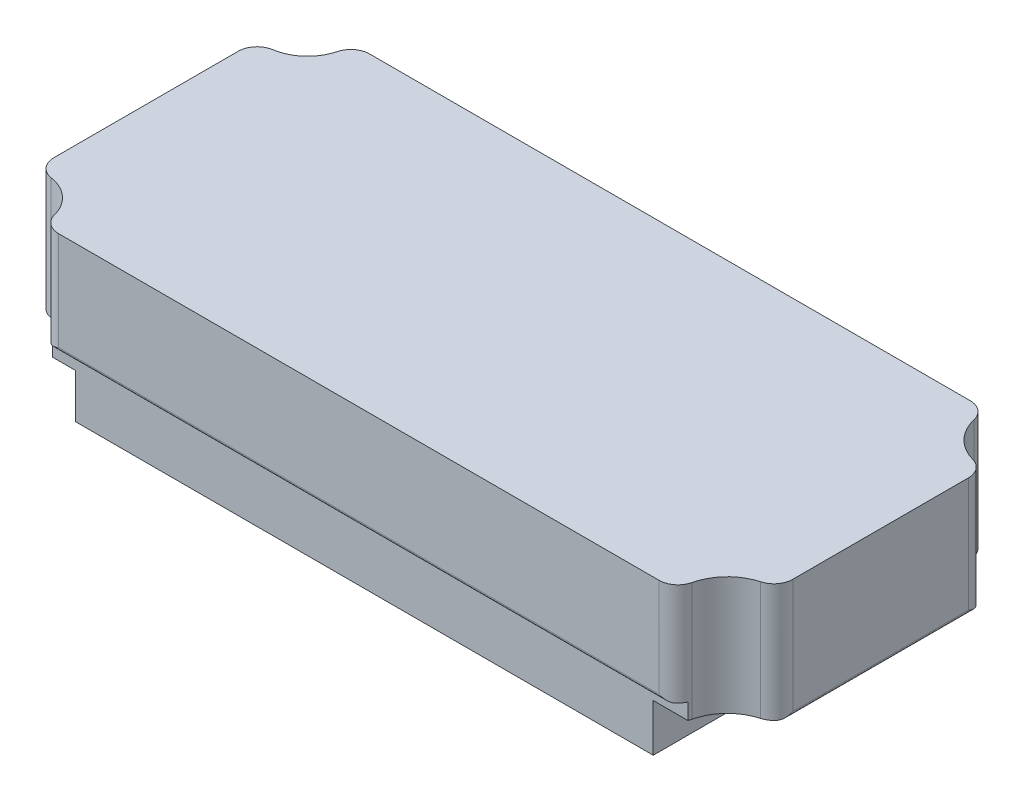
ISO-10303-21;
HEADER;
FILE_DESCRIPTION(('STEP AP214'),'2;1');
FILE_NAME('part.step','',(''),(''),'','','');
FILE_SCHEMA(('AUTOMOTIVE_DESIGN { 1 0 10303 214 1 1 1 1 }'));
ENDSEC;
DATA;
#1=APPLICATION_CONTEXT('core data for automotive mechanical design processes');
#2=APPLICATION_PROTOCOL_DEFINITION('international standard','automotive_design',2000,#1);
#3=PRODUCT_CONTEXT('',#1,'mechanical');
#4=PRODUCT('Part','Part','',(#3));
#5=PRODUCT_RELATED_PRODUCT_CATEGORY('part','',(#4));
#6=PRODUCT_DEFINITION_FORMATION('','',#4);
#7=PRODUCT_DEFINITION_CONTEXT('part definition',#1,'design');
#8=PRODUCT_DEFINITION('design','',#6,#7);
#9=PRODUCT_DEFINITION_SHAPE('','',#8);
#10=(LENGTH_UNIT() NAMED_UNIT(*) SI_UNIT(.MILLI.,.METRE.));
#11=(NAMED_UNIT(*) PLANE_ANGLE_UNIT() SI_UNIT($,.RADIAN.));
#12=(NAMED_UNIT(*) SI_UNIT($,.STERADIAN.) SOLID_ANGLE_UNIT());
#13=UNCERTAINTY_MEASURE_WITH_UNIT(LENGTH_MEASURE(1.E-05),#10,'distance_accuracy_value','');
#14=(GEOMETRIC_REPRESENTATION_CONTEXT(3) GLOBAL_UNCERTAINTY_ASSIGNED_CONTEXT((#13)) GLOBAL_UNIT_ASSIGNED_CONTEXT((#10,
#11,#12)) REPRESENTATION_CONTEXT('',''));
#15=CARTESIAN_POINT('',(0.,0.,0.));
#16=DIRECTION('',(0.,0.,1.));
#17=DIRECTION('',(1.,0.,0.));
#18=AXIS2_PLACEMENT_3D('',#15,#16,#17);
#19=CARTESIAN_POINT('',(-39.4234207868496,21.85,18.0099999999963));
#20=DIRECTION('',(0.,-1.,0.));
#21=DIRECTION('',(0.,0.,-1.));
#22=AXIS2_PLACEMENT_3D('',#19,#20,#21);
#23=CYLINDRICAL_SURFACE('',#22,2.49000000000371);
#24=CARTESIAN_POINT('',(-39.4234207868496,5.85,18.0099999999963));
#25=DIRECTION('',(0.,-1.,0.));
#26=DIRECTION('',(0.,0.,-1.));
#27=AXIS2_PLACEMENT_3D('',#24,#25,#26);
#28=CIRCLE('',#27,2.49000000000371);
#29=CARTESIAN_POINT('',(-41.7081527186112,5.85,19.));
#30=VERTEX_POINT('',#29);
#31=CARTESIAN_POINT('',(-41.833947517424,5.85,18.634068010076));
#32=VERTEX_POINT('',#31);
#33=EDGE_CURVE('E318',#30,#32,#28,.T.);
#34=ORIENTED_EDGE('',*,*,#33,.F.);
#35=DIRECTION('',(0.,-1.,0.));
#36=VECTOR('',#35,1.);
#37=CARTESIAN_POINT('',(-41.7081527186112,21.85,19.));
#38=LINE('',#37,#36);
#39=CARTESIAN_POINT('',(-41.7081527186112,8.35,19.));
#40=VERTEX_POINT('',#39);
#41=EDGE_CURVE('E630',#40,#30,#38,.T.);
#42=ORIENTED_EDGE('',*,*,#41,.F.);
#43=CARTESIAN_POINT('',(-39.4234207868496,8.35,18.0099999999963));
#44=DIRECTION('',(0.,-1.,0.));
#45=DIRECTION('',(0.,0.,-1.));
#46=AXIS2_PLACEMENT_3D('',#43,#44,#45);
#47=CIRCLE('',#46,2.49000000000371);
#48=CARTESIAN_POINT('',(-40.9200837415604,8.35,20.));
#49=VERTEX_POINT('',#48);
#50=EDGE_CURVE('E430',#49,#40,#47,.T.);
#51=ORIENTED_EDGE('',*,*,#50,.F.);
#52=CARTESIAN_POINT('',(-40.9200837415604,8.35,20.));
#53=CARTESIAN_POINT('',(-40.8886968921512,8.35001842418056,20.0236123195986));
#54=CARTESIAN_POINT('',(-40.8567785136693,8.3516705893633,20.0464488723854));
#55=CARTESIAN_POINT('',(-40.7921398322998,8.35774286900045,20.0904390050354));
#56=CARTESIAN_POINT('',(-40.7594211696703,8.36215771425095,20.1115957024869));
#57=CARTESIAN_POINT('',(-40.6935463648069,8.37322199606692,20.1520474858787));
#58=CARTESIAN_POINT('',(-40.6603946958646,8.37985607094456,20.1713542266435));
#59=CARTESIAN_POINT('',(-40.5935524581982,8.39499936083978,20.2082607478386));
#60=CARTESIAN_POINT('',(-40.5598615489058,8.40350980805456,20.2258593955906));
#61=CARTESIAN_POINT('',(-40.4705197955371,8.42798978748029,20.2699790746975));
#62=CARTESIAN_POINT('',(-40.4145127997427,8.44526366837736,20.2950674194311));
#63=CARTESIAN_POINT('',(-40.3017262532036,8.48289528376704,20.3407481172562));
#64=CARTESIAN_POINT('',(-40.2449463855545,8.50325432021062,20.3613385632128));
#65=CARTESIAN_POINT('',(-40.0733593150087,8.56786691046003,20.4166898107985));
#66=CARTESIAN_POINT('',(-39.9576488122184,8.61555155971634,20.4448633881303));
#67=CARTESIAN_POINT('',(-39.7735259173764,8.6944758334201,20.4762307918894));
#68=CARTESIAN_POINT('',(-39.7053544997696,8.7243554537804,20.4849370573848));
#69=CARTESIAN_POINT('',(-39.5689552918689,8.78479751133603,20.4966827348011));
#70=CARTESIAN_POINT('',(-39.5007279148792,8.81535839636182,20.4997339145209));
#71=CARTESIAN_POINT('',(-39.4294923256068,8.84727928134149,20.4999944475638));
#72=CARTESIAN_POINT('',(-39.4264565232585,8.84863965743936,20.4999999990283));
#73=CARTESIAN_POINT('',(-39.4234207868496,8.85000000000043,20.5));
#74=B_SPLINE_CURVE_WITH_KNOTS('',3,(#52,#53,#54,#55,#56,#57,#58,#59,#60,#61,#62,#63,#64,#65,#66,
#67,#68,#69,#70,#71,#72,#73),.UNSPECIFIED.,.F.,.F.,(4,2,2,2,2,2,2,2,2,2,4),(0.,
0.117726633475876,0.235229410834652,0.35193509864507,0.468717655541683,0.659676139059862,
0.850715433585463,1.2339705990191,1.45863657718136,1.68283451552407,1.69281450939726),.UNSPECIFIED.);
#75=CARTESIAN_POINT('',(-39.4234207868496,8.85,20.5));
#76=VERTEX_POINT('',#75);
#77=EDGE_CURVE('E421',#76,#49,#74,.F.);
#78=ORIENTED_EDGE('',*,*,#77,.F.);
#79=DIRECTION('',(0.,-1.,0.));
#80=VECTOR('',#79,1.);
#81=CARTESIAN_POINT('',(-39.4234207868496,21.85,20.5));
#82=LINE('',#81,#80);
#83=CARTESIAN_POINT('',(-39.4234207868496,21.85,20.5));
#84=VERTEX_POINT('',#83);
#85=EDGE_CURVE('E511',#84,#76,#82,.T.);
#86=ORIENTED_EDGE('',*,*,#85,.F.);
#87=CARTESIAN_POINT('',(-39.4234207868496,21.85,18.0099999999963));
#88=DIRECTION('',(0.,1.,0.));
#89=DIRECTION('',(0.,0.,1.));
#90=AXIS2_PLACEMENT_3D('',#87,#88,#89);
#91=CIRCLE('',#90,2.49000000000371);
#92=CARTESIAN_POINT('',(-41.833947517424,21.85,18.634068010076));
#93=VERTEX_POINT('',#92);
#94=EDGE_CURVE('E533',#93,#84,#91,.T.);
#95=ORIENTED_EDGE('',*,*,#94,.F.);
#96=DIRECTION('',(0.,-1.,0.));
#97=VECTOR('',#96,1.);
#98=CARTESIAN_POINT('',(-41.833947517424,21.85,18.634068010076));
#99=LINE('',#98,#97);
#100=EDGE_CURVE('E474',#93,#32,#99,.T.);
#101=ORIENTED_EDGE('',*,*,#100,.T.);
#102=EDGE_LOOP('',(#34,#42,#51,#78,#86,#95,#101));
#103=FACE_BOUND('',#102,.T.);
#104=ADVANCED_FACE('F38',(#103),#23,.T.);
#105=CARTESIAN_POINT('',(39.7095652284968,21.85,18.0099999999986));
#106=DIRECTION('',(0.,-1.,0.));
#107=DIRECTION('',(0.,0.,-1.));
#108=AXIS2_PLACEMENT_3D('',#105,#106,#107);
#109=CYLINDRICAL_SURFACE('',#108,2.49000000000138);
#110=CARTESIAN_POINT('',(39.7095652284968,6.25,18.0099999999986));
#111=DIRECTION('',(0.,-1.,0.));
#112=DIRECTION('',(0.,0.,-1.));
#113=AXIS2_PLACEMENT_3D('',#110,#111,#112);
#114=CIRCLE('',#113,2.49000000000138);
#115=CARTESIAN_POINT('',(42.134162777816,6.25,18.576945080092));
#116=VERTEX_POINT('',#115);
#117=CARTESIAN_POINT('',(41.9942971602569,6.25,19.));
#118=VERTEX_POINT('',#117);
#119=EDGE_CURVE('E336',#116,#118,#114,.T.);
#120=ORIENTED_EDGE('',*,*,#119,.F.);
#121=DIRECTION('',(0.,-1.,0.));
#122=VECTOR('',#121,1.);
#123=CARTESIAN_POINT('',(42.134162777816,21.85,18.576945080092));
#124=LINE('',#123,#122);
#125=CARTESIAN_POINT('',(42.134162777816,21.85,18.576945080092));
#126=VERTEX_POINT('',#125);
#127=EDGE_CURVE('E512',#126,#116,#124,.T.);
#128=ORIENTED_EDGE('',*,*,#127,.F.);
#129=CARTESIAN_POINT('',(39.7095652284968,21.85,18.0099999999986));
#130=DIRECTION('',(0.,1.,0.));
#131=DIRECTION('',(0.,0.,1.));
#132=AXIS2_PLACEMENT_3D('',#129,#130,#131);
#133=CIRCLE('',#132,2.49000000000138);
#134=CARTESIAN_POINT('',(39.709565228497,21.85,20.5));
#135=VERTEX_POINT('',#134);
#136=EDGE_CURVE('E507',#135,#126,#133,.T.);
#137=ORIENTED_EDGE('',*,*,#136,.F.);
#138=DIRECTION('',(0.,-1.,0.));
#139=VECTOR('',#138,1.);
#140=CARTESIAN_POINT('',(39.709565228497,21.85,20.5));
#141=LINE('',#140,#139);
#142=CARTESIAN_POINT('',(39.7095652284968,8.85,20.5));
#143=VERTEX_POINT('',#142);
#144=EDGE_CURVE('E505',#135,#143,#141,.T.);
#145=ORIENTED_EDGE('',*,*,#144,.T.);
#146=CARTESIAN_POINT('',(41.2062281832068,8.35,20.));
#147=CARTESIAN_POINT('',(41.1748413337976,8.35001842418055,20.0236123195986));
#148=CARTESIAN_POINT('',(41.1429229553158,8.3516705893633,20.0464488723854));
#149=CARTESIAN_POINT('',(41.0782842739463,8.35774286900045,20.0904390050354));
#150=CARTESIAN_POINT('',(41.0455656113169,8.36215771425094,20.1115957024869));
#151=CARTESIAN_POINT('',(40.9796908064535,8.3732219960669,20.1520474858787));
#152=CARTESIAN_POINT('',(40.9465391375113,8.37985607094454,20.1713542266435));
#153=CARTESIAN_POINT('',(40.8796968998449,8.39499936083975,20.2082607478385));
#154=CARTESIAN_POINT('',(40.8460059905525,8.40350980805453,20.2258593955906));
#155=CARTESIAN_POINT('',(40.756664237184,8.42798978748023,20.2699790746974));
#156=CARTESIAN_POINT('',(40.7006572413896,8.44526366837728,20.295067419431));
#157=CARTESIAN_POINT('',(40.5878706948506,8.48289528376694,20.3407481172561));
#158=CARTESIAN_POINT('',(40.5310908272016,8.5032543202105,20.3613385632127));
#159=CARTESIAN_POINT('',(40.359503756656,8.56786691045986,20.4166898107984));
#160=CARTESIAN_POINT('',(40.2437932538658,8.61555155971612,20.4448633881302));
#161=CARTESIAN_POINT('',(40.0596703590239,8.69447583341988,20.4762307918893));
#162=CARTESIAN_POINT('',(39.9914989414171,8.72435545378022,20.4849370573848));
#163=CARTESIAN_POINT('',(39.8550997335162,8.78479751133593,20.4966827348011));
#164=CARTESIAN_POINT('',(39.7868723565265,8.81535839636177,20.4997339145209));
#165=CARTESIAN_POINT('',(39.7156367672539,8.84727928134148,20.4999944475638));
#166=CARTESIAN_POINT('',(39.7126009649057,8.84863965743936,20.4999999990283));
#167=CARTESIAN_POINT('',(39.7095652284968,8.85000000000043,20.5));
#168=B_SPLINE_CURVE_WITH_KNOTS('',3,(#146,#147,#148,#149,#150,#151,#152,#153,#154,#155,#156,
#157,#158,#159,#160,#161,#162,#163,#164,#165,#166,#167),.UNSPECIFIED.,.F.,.F.,(4,2,2,2,2,2,2,2,
2,2,4),(0.,0.117726633475785,0.23522941083446,0.351935098644792,0.468717655541302,
0.659676139059281,0.850715433584689,1.23397059901794,1.45863657718043,1.68283451552337,
1.69281450939657),.UNSPECIFIED.);
#169=CARTESIAN_POINT('',(41.2062281832068,8.35,20.));
#170=VERTEX_POINT('',#169);
#171=EDGE_CURVE('E396',#170,#143,#168,.T.);
#172=ORIENTED_EDGE('',*,*,#171,.F.);
#173=CARTESIAN_POINT('',(39.7095652284968,8.35,18.0099999999986));
#174=DIRECTION('',(0.,-1.,0.));
#175=DIRECTION('',(0.,0.,-1.));
#176=AXIS2_PLACEMENT_3D('',#173,#174,#175);
#177=CIRCLE('',#176,2.49000000000138);
#178=CARTESIAN_POINT('',(41.9942971602569,8.35,19.));
#179=VERTEX_POINT('',#178);
#180=EDGE_CURVE('E406',#179,#170,#177,.T.);
#181=ORIENTED_EDGE('',*,*,#180,.F.);
#182=DIRECTION('',(0.,-1.,0.));
#183=VECTOR('',#182,1.);
#184=CARTESIAN_POINT('',(41.9942971602569,21.85,19.));
#185=LINE('',#184,#183);
#186=EDGE_CURVE('E629',#118,#179,#185,.F.);
#187=ORIENTED_EDGE('',*,*,#186,.F.);
#188=EDGE_LOOP('',(#120,#128,#137,#145,#172,#181,#187));
#189=FACE_BOUND('',#188,.T.);
#190=ADVANCED_FACE('F387',(#189),#109,.T.);
#191=CARTESIAN_POINT('',(-45.9100000000024,0.,-12.1512039139768));
#192=DIRECTION('',(0.,1.,0.));
#193=DIRECTION('',(0.,0.,1.));
#194=AXIS2_PLACEMENT_3D('',#191,#192,#193);
#195=PLANE('',#194);
#196=DIRECTION('',(0.,0.,-1.));
#197=VECTOR('',#196,1.);
#198=CARTESIAN_POINT('',(37.44,0.,20.5));
#199=LINE('',#198,#197);
#200=CARTESIAN_POINT('',(37.44,0.,19.));
#201=VERTEX_POINT('',#200);
#202=CARTESIAN_POINT('',(37.44,0.,-20.5));
#203=VERTEX_POINT('',#202);
#204=EDGE_CURVE('E269',#201,#203,#199,.T.);
#205=ORIENTED_EDGE('',*,*,#204,.F.);
#206=DIRECTION('',(1.,0.,0.));
#207=VECTOR('',#206,1.);
#208=CARTESIAN_POINT('',(-45.9100000000024,0.,19.));
#209=LINE('',#208,#207);
#210=CARTESIAN_POINT('',(-38.7,0.,19.));
#211=VERTEX_POINT('',#210);
#212=EDGE_CURVE('E470',#211,#201,#209,.T.);
#213=ORIENTED_EDGE('',*,*,#212,.F.);
#214=DIRECTION('',(0.,0.,-1.));
#215=VECTOR('',#214,1.);
#216=CARTESIAN_POINT('',(-38.7,0.,20.5));
#217=LINE('',#216,#215);
#218=CARTESIAN_POINT('',(-38.7,0.,-20.5));
#219=VERTEX_POINT('',#218);
#220=EDGE_CURVE('E307',#211,#219,#217,.T.);
#221=ORIENTED_EDGE('',*,*,#220,.T.);
#222=DIRECTION('',(-1.,0.,0.));
#223=VECTOR('',#222,1.);
#224=CARTESIAN_POINT('',(39.709565228497,0.,-20.5));
#225=LINE('',#224,#223);
#226=EDGE_CURVE('E429',#203,#219,#225,.T.);
#227=ORIENTED_EDGE('',*,*,#226,.F.);
#228=EDGE_LOOP('',(#205,#213,#221,#227));
#229=FACE_BOUND('',#228,.T.);
#230=ADVANCED_FACE('F391',(#229),#195,.F.);
#231=CARTESIAN_POINT('',(-45.9100000000024,21.85,-12.1512039139768));
#232=DIRECTION('',(0.,-1.,0.));
#233=DIRECTION('',(0.,0.,-1.));
#234=AXIS2_PLACEMENT_3D('',#231,#232,#233);
#235=CYLINDRICAL_SURFACE('',#234,2.48999999999756);
#236=CARTESIAN_POINT('',(-45.9100000000024,5.85,-12.1512039139768));
#237=DIRECTION('',(0.,-1.,0.));
#238=DIRECTION('',(0.,0.,-1.));
#239=AXIS2_PLACEMENT_3D('',#236,#237,#238);
#240=CIRCLE('',#239,2.48999999999756);
#241=CARTESIAN_POINT('',(-47.9,5.85,-13.6478668686856));
#242=VERTEX_POINT('',#241);
#243=CARTESIAN_POINT('',(-46.286322286387,5.85,-14.612602202909));
#244=VERTEX_POINT('',#243);
#245=EDGE_CURVE('E333',#242,#244,#240,.T.);
#246=ORIENTED_EDGE('',*,*,#245,.F.);
#247=CARTESIAN_POINT('',(-47.9,5.85,-13.6478668686856));
#248=CARTESIAN_POINT('',(-47.9236123195986,5.85001842418056,-13.6164800192764));
#249=CARTESIAN_POINT('',(-47.9464488723854,5.8516705893633,-13.5845616407947));
#250=CARTESIAN_POINT('',(-47.9904390050353,5.85774286900044,-13.5199229594253));
#251=CARTESIAN_POINT('',(-48.0115957024868,5.86215771425093,-13.4872042967959));
#252=CARTESIAN_POINT('',(-48.0520474858786,5.87322199606688,-13.4213294919326));
#253=CARTESIAN_POINT('',(-48.0713542266434,5.87985607094451,-13.3881778229905));
#254=CARTESIAN_POINT('',(-48.1082607478384,5.89499936083969,-13.3213355853242));
#255=CARTESIAN_POINT('',(-48.1258593955904,5.90350980805446,-13.2876446760319));
#256=CARTESIAN_POINT('',(-48.1699790746973,5.92798978748013,-13.1983029226635));
#257=CARTESIAN_POINT('',(-48.1950674194308,5.94526366837715,-13.1422959268692));
#258=CARTESIAN_POINT('',(-48.2407481172559,5.98289528376675,-13.0295093803305));
#259=CARTESIAN_POINT('',(-48.2613385632125,6.00325432021029,-12.9727295126816));
#260=CARTESIAN_POINT('',(-48.3166898107982,6.06786691045954,-12.8011424421363));
#261=CARTESIAN_POINT('',(-48.34486338813,6.11555155971568,-12.6854319393463));
#262=CARTESIAN_POINT('',(-48.3762307918892,6.19447583341955,-12.5013090445046));
#263=CARTESIAN_POINT('',(-48.3849370573847,6.22435545378003,-12.4331376268976));
#264=CARTESIAN_POINT('',(-48.3966827348011,6.28479751133567,-12.2967384189964));
#265=CARTESIAN_POINT('',(-48.3997339145209,6.31535839636128,-12.2285110420065));
#266=CARTESIAN_POINT('',(-48.3999944475638,6.34727928134144,-12.157275452734));
#267=CARTESIAN_POINT('',(-48.3999999990283,6.34863965743934,-12.1542396503857));
#268=CARTESIAN_POINT('',(-48.4,6.35000000000042,-12.1512039139768));
#269=B_SPLINE_CURVE_WITH_KNOTS('',3,(#247,#248,#249,#250,#251,#252,#253,#254,#255,#256,#257,
#258,#259,#260,#261,#262,#263,#264,#265,#266,#267,#268),.UNSPECIFIED.,.F.,.F.,(4,2,2,2,2,2,2,2,
2,2,4),(0.,0.117726633475636,0.23522941083417,0.35193509864432,0.468717655540657,
0.659676139058309,0.850715433583384,1.233970599016,1.45863657717891,1.68283451552225,
1.69281450939544),.UNSPECIFIED.);
#270=CARTESIAN_POINT('',(-48.4,6.35000000000042,-12.151203913975));
#271=VERTEX_POINT('',#270);
#272=EDGE_CURVE('E363',#271,#242,#269,.F.);
#273=ORIENTED_EDGE('',*,*,#272,.F.);
#274=DIRECTION('',(0.,-1.,0.));
#275=VECTOR('',#274,1.);
#276=CARTESIAN_POINT('',(-48.4,21.85,-12.151203913975));
#277=LINE('',#276,#275);
#278=CARTESIAN_POINT('',(-48.4,21.85,-12.151203913975));
#279=VERTEX_POINT('',#278);
#280=EDGE_CURVE('E458',#279,#271,#277,.T.);
#281=ORIENTED_EDGE('',*,*,#280,.F.);
#282=CARTESIAN_POINT('',(-45.9100000000024,21.85,-12.1512039139768));
#283=DIRECTION('',(0.,1.,0.));
#284=DIRECTION('',(0.,0.,1.));
#285=AXIS2_PLACEMENT_3D('',#282,#283,#284);
#286=CIRCLE('',#285,2.48999999999756);
#287=CARTESIAN_POINT('',(-46.286322286387,21.85,-14.612602202909));
#288=VERTEX_POINT('',#287);
#289=EDGE_CURVE('E432',#288,#279,#286,.T.);
#290=ORIENTED_EDGE('',*,*,#289,.F.);
#291=DIRECTION('',(0.,-1.,0.));
#292=VECTOR('',#291,1.);
#293=CARTESIAN_POINT('',(-46.286322286387,21.85,-14.612602202909));
#294=LINE('',#293,#292);
#295=EDGE_CURVE('E587',#288,#244,#294,.T.);
#296=ORIENTED_EDGE('',*,*,#295,.T.);
#297=EDGE_LOOP('',(#246,#273,#281,#290,#296));
#298=FACE_BOUND('',#297,.T.);
#299=ADVANCED_FACE('F40',(#298),#235,.T.);
#300=CARTESIAN_POINT('',(-48.4,21.85,-12.151203913975));
#301=DIRECTION('',(1.,0.,0.));
#302=DIRECTION('',(0.,0.,-1.));
#303=AXIS2_PLACEMENT_3D('',#300,#301,#302);
#304=PLANE('',#303);
#305=DIRECTION('',(0.,0.,-1.));
#306=VECTOR('',#305,1.);
#307=CARTESIAN_POINT('',(-48.4,6.35000000000042,20.5));
#308=LINE('',#307,#306);
#309=CARTESIAN_POINT('',(-48.4,6.35000000000042,12.1512039139768));
#310=VERTEX_POINT('',#309);
#311=EDGE_CURVE('E298',#310,#271,#308,.T.);
#312=ORIENTED_EDGE('',*,*,#311,.F.);
#313=DIRECTION('',(0.,-1.,0.));
#314=VECTOR('',#313,1.);
#315=CARTESIAN_POINT('',(-48.4,21.85,12.151203913975));
#316=LINE('',#315,#314);
#317=CARTESIAN_POINT('',(-48.4,21.85,12.151203913975));
#318=VERTEX_POINT('',#317);
#319=EDGE_CURVE('E455',#318,#310,#316,.T.);
#320=ORIENTED_EDGE('',*,*,#319,.F.);
#321=DIRECTION('',(0.,0.,1.));
#322=VECTOR('',#321,1.);
#323=CARTESIAN_POINT('',(-48.4,21.85,-12.151203913975));
#324=LINE('',#323,#322);
#325=EDGE_CURVE('E582',#279,#318,#324,.T.);
#326=ORIENTED_EDGE('',*,*,#325,.F.);
#327=ORIENTED_EDGE('',*,*,#280,.T.);
#328=EDGE_LOOP('',(#312,#320,#326,#327));
#329=FACE_BOUND('',#328,.T.);
#330=ADVANCED_FACE('F443',(#329),#304,.F.);
#331=CARTESIAN_POINT('',(-45.9100000000023,21.85,12.1512039139768));
#332=DIRECTION('',(0.,-1.,0.));
#333=DIRECTION('',(0.,0.,-1.));
#334=AXIS2_PLACEMENT_3D('',#331,#332,#333);
#335=CYLINDRICAL_SURFACE('',#334,2.48999999999768);
#336=CARTESIAN_POINT('',(-45.9100000000023,5.85,12.1512039139768));
#337=DIRECTION('',(0.,-1.,0.));
#338=DIRECTION('',(0.,0.,-1.));
#339=AXIS2_PLACEMENT_3D('',#336,#337,#338);
#340=CIRCLE('',#339,2.48999999999768);
#341=CARTESIAN_POINT('',(-46.286322418136,5.85,14.612602182766));
#342=VERTEX_POINT('',#341);
#343=CARTESIAN_POINT('',(-47.9,5.85,13.6478668686856));
#344=VERTEX_POINT('',#343);
#345=EDGE_CURVE('E324',#342,#344,#340,.T.);
#346=ORIENTED_EDGE('',*,*,#345,.F.);
#347=DIRECTION('',(0.,-1.,0.));
#348=VECTOR('',#347,1.);
#349=CARTESIAN_POINT('',(-46.286322418136,21.85,14.612602182766));
#350=LINE('',#349,#348);
#351=CARTESIAN_POINT('',(-46.286322418136,21.85,14.612602182766));
#352=VERTEX_POINT('',#351);
#353=EDGE_CURVE('E466',#352,#342,#350,.T.);
#354=ORIENTED_EDGE('',*,*,#353,.F.);
#355=CARTESIAN_POINT('',(-45.9100000000023,21.85,12.1512039139768));
#356=DIRECTION('',(0.,1.,0.));
#357=DIRECTION('',(0.,0.,1.));
#358=AXIS2_PLACEMENT_3D('',#355,#356,#357);
#359=CIRCLE('',#358,2.48999999999768);
#360=EDGE_CURVE('E464',#318,#352,#359,.T.);
#361=ORIENTED_EDGE('',*,*,#360,.F.);
#362=ORIENTED_EDGE('',*,*,#319,.T.);
#363=CARTESIAN_POINT('',(-47.9,5.85,13.6478668686856));
#364=CARTESIAN_POINT('',(-47.9236123195986,5.85001842418055,13.6164800192764));
#365=CARTESIAN_POINT('',(-47.9464488723853,5.8516705893633,13.5845616407947));
#366=CARTESIAN_POINT('',(-47.9904390050353,5.85774286900044,13.5199229594253));
#367=CARTESIAN_POINT('',(-48.0115957024868,5.86215771425092,13.4872042967959));
#368=CARTESIAN_POINT('',(-48.0520474858786,5.87322199606687,13.4213294919327));
#369=CARTESIAN_POINT('',(-48.0713542266434,5.87985607094451,13.3881778229905));
#370=CARTESIAN_POINT('',(-48.1082607478384,5.89499936083969,13.3213355853242));
#371=CARTESIAN_POINT('',(-48.1258593955904,5.90350980805446,13.2876446760319));
#372=CARTESIAN_POINT('',(-48.1699790746973,5.92798978748014,13.1983029226635));
#373=CARTESIAN_POINT('',(-48.1950674194309,5.94526366837717,13.1422959268692));
#374=CARTESIAN_POINT('',(-48.2407481172559,5.98289528376676,13.0295093803305));
#375=CARTESIAN_POINT('',(-48.2613385632125,6.0032543202103,12.9727295126815));
#376=CARTESIAN_POINT('',(-48.3166898107982,6.06786691045957,12.8011424421363));
#377=CARTESIAN_POINT('',(-48.34486338813,6.11555155971578,12.6854319393463));
#378=CARTESIAN_POINT('',(-48.3762307918892,6.19447583341952,12.5013090445045));
#379=CARTESIAN_POINT('',(-48.3849370573847,6.22435545377992,12.4331376268975));
#380=CARTESIAN_POINT('',(-48.3966827348011,6.2847975113358,12.2967384189964));
#381=CARTESIAN_POINT('',(-48.3997339145209,6.31535839636176,12.2285110420066));
#382=CARTESIAN_POINT('',(-48.3999944475638,6.34727928134148,12.157275452734));
#383=CARTESIAN_POINT('',(-48.3999999990283,6.34863965743936,12.1542396503857));
#384=CARTESIAN_POINT('',(-48.4,6.35000000000042,12.1512039139768));
#385=B_SPLINE_CURVE_WITH_KNOTS('',3,(#363,#364,#365,#366,#367,#368,#369,#370,#371,#372,#373,
#374,#375,#376,#377,#378,#379,#380,#381,#382,#383,#384),.UNSPECIFIED.,.F.,.F.,(4,2,2,2,2,2,2,2,
2,2,4),(0.,0.117726633475628,0.235229410834152,0.351935098644322,0.468717655540689,
0.659676139058363,0.850715433583456,1.23397059901608,1.45863657717896,1.68283451552229,
1.69281450939548),.UNSPECIFIED.);
#386=EDGE_CURVE('E11',#344,#310,#385,.T.);
#387=ORIENTED_EDGE('',*,*,#386,.F.);
#388=EDGE_LOOP('',(#346,#354,#361,#362,#387));
#389=FACE_BOUND('',#388,.T.);
#390=ADVANCED_FACE('F439',(#389),#335,.T.);
#391=CARTESIAN_POINT('',(-47.1100000000021,21.85,20.0000000000012));
#392=DIRECTION('',(0.,-1.,0.));
#393=DIRECTION('',(0.,0.,-1.));
#394=AXIS2_PLACEMENT_3D('',#391,#392,#393);
#395=CYLINDRICAL_SURFACE('',#394,5.45000000000174);
#396=CARTESIAN_POINT('',(-47.1100000000021,5.85,20.0000000000012));
#397=DIRECTION('',(0.,-1.,0.));
#398=DIRECTION('',(0.,0.,-1.));
#399=AXIS2_PLACEMENT_3D('',#396,#397,#398);
#400=CIRCLE('',#399,5.45000000000174);
#401=EDGE_CURVE('E321',#32,#342,#400,.F.);
#402=ORIENTED_EDGE('',*,*,#401,.F.);
#403=ORIENTED_EDGE('',*,*,#100,.F.);
#404=CARTESIAN_POINT('',(-47.1100000000021,21.85,20.0000000000012));
#405=DIRECTION('',(0.,-1.,0.));
#406=DIRECTION('',(0.,0.,-1.));
#407=AXIS2_PLACEMENT_3D('',#404,#405,#406);
#408=CIRCLE('',#407,5.45000000000174);
#409=EDGE_CURVE('E536',#352,#93,#408,.T.);
#410=ORIENTED_EDGE('',*,*,#409,.F.);
#411=ORIENTED_EDGE('',*,*,#353,.T.);
#412=EDGE_LOOP('',(#402,#403,#410,#411));
#413=FACE_BOUND('',#412,.T.);
#414=ADVANCED_FACE('F385',(#413),#395,.F.);
#415=CARTESIAN_POINT('',(48.2200000000021,21.85,20.0000000000014));
#416=DIRECTION('',(0.,-1.,0.));
#417=DIRECTION('',(0.,0.,-1.));
#418=AXIS2_PLACEMENT_3D('',#415,#416,#417);
#419=CYLINDRICAL_SURFACE('',#418,6.25000000000196);
#420=CARTESIAN_POINT('',(48.2200000000021,6.25,20.0000000000014));
#421=DIRECTION('',(0.,-1.,0.));
#422=DIRECTION('',(0.,0.,-1.));
#423=AXIS2_PLACEMENT_3D('',#420,#421,#422);
#424=CIRCLE('',#423,6.25000000000196);
#425=CARTESIAN_POINT('',(46.568112128146,6.25,13.972250298924));
#426=VERTEX_POINT('',#425);
#427=EDGE_CURVE('E339',#426,#116,#424,.F.);
#428=ORIENTED_EDGE('',*,*,#427,.F.);
#429=DIRECTION('',(0.,-1.,0.));
#430=VECTOR('',#429,1.);
#431=CARTESIAN_POINT('',(46.568112128146,21.85,13.972250298924));
#432=LINE('',#431,#430);
#433=CARTESIAN_POINT('',(46.568112128146,21.85,13.972250298924));
#434=VERTEX_POINT('',#433);
#435=EDGE_CURVE('E520',#434,#426,#432,.T.);
#436=ORIENTED_EDGE('',*,*,#435,.F.);
#437=CARTESIAN_POINT('',(48.2200000000021,21.85,20.0000000000014));
#438=DIRECTION('',(0.,-1.,0.));
#439=DIRECTION('',(0.,0.,-1.));
#440=AXIS2_PLACEMENT_3D('',#437,#438,#439);
#441=CIRCLE('',#440,6.25000000000196);
#442=EDGE_CURVE('E627',#126,#434,#441,.T.);
#443=ORIENTED_EDGE('',*,*,#442,.F.);
#444=ORIENTED_EDGE('',*,*,#127,.T.);
#445=EDGE_LOOP('',(#428,#436,#443,#444));
#446=FACE_BOUND('',#445,.T.);
#447=ADVANCED_FACE('F379',(#446),#419,.F.);
#448=CARTESIAN_POINT('',(45.9100000000018,21.85,11.5707948180165));
#449=DIRECTION('',(0.,-1.,0.));
#450=DIRECTION('',(0.,0.,-1.));
#451=AXIS2_PLACEMENT_3D('',#448,#449,#450);
#452=CYLINDRICAL_SURFACE('',#451,2.48999999999818);
#453=CARTESIAN_POINT('',(47.9,6.25,13.0674577727255));
#454=CARTESIAN_POINT('',(47.9236123195986,6.25001842418055,13.0360709233163));
#455=CARTESIAN_POINT('',(47.9464488723853,6.2516705893633,13.0041525448346));
#456=CARTESIAN_POINT('',(47.9904390050353,6.25774286900044,12.9395138634652));
#457=CARTESIAN_POINT('',(48.0115957024868,6.26215771425092,12.9067952008358));
#458=CARTESIAN_POINT('',(48.0520474858786,6.27322199606687,12.8409203959725));
#459=CARTESIAN_POINT('',(48.0713542266434,6.27985607094451,12.8077687270303));
#460=CARTESIAN_POINT('',(48.1082607478384,6.2949993608397,12.7409264893641));
#461=CARTESIAN_POINT('',(48.1258593955905,6.30350980805447,12.7072355800717));
#462=CARTESIAN_POINT('',(48.1699790746973,6.32798978748015,12.6178938267033));
#463=CARTESIAN_POINT('',(48.1950674194309,6.34526366837719,12.561886830909));
#464=CARTESIAN_POINT('',(48.2407481172559,6.38289528376679,12.4491002843702));
#465=CARTESIAN_POINT('',(48.2613385632125,6.40325432021032,12.3923204167212));
#466=CARTESIAN_POINT('',(48.3166898107982,6.46786691045964,12.220733346176));
#467=CARTESIAN_POINT('',(48.34486338813,6.51555155971595,12.105022843386));
#468=CARTESIAN_POINT('',(48.3762307918892,6.5944758334195,11.9208999485441));
#469=CARTESIAN_POINT('',(48.3849370573847,6.62435545377974,11.8527285309371));
#470=CARTESIAN_POINT('',(48.3966827348011,6.68479751133604,11.7163293230362));
#471=CARTESIAN_POINT('',(48.3997339145209,6.71535839636257,11.6481019460467));
#472=CARTESIAN_POINT('',(48.3999944475638,6.74727928134155,11.5768663567737));
#473=CARTESIAN_POINT('',(48.3999999990283,6.74863965743939,11.5738305544254));
#474=CARTESIAN_POINT('',(48.4,6.75000000000042,11.5707948180165));
#475=B_SPLINE_CURVE_WITH_KNOTS('',3,(#453,#454,#455,#456,#457,#458,#459,#460,#461,#462,#463,
#464,#465,#466,#467,#468,#469,#470,#471,#472,#473,#474),.UNSPECIFIED.,.F.,.F.,(4,2,2,2,2,2,2,2,
2,2,4),(0.,0.117726633475629,0.235229410834149,0.351935098644366,0.468717655540777,
0.659676139058508,0.850715433583658,1.23397059901633,1.45863657717916,1.68283451552243,
1.69281450939563),.UNSPECIFIED.);
#476=CARTESIAN_POINT('',(48.4,6.75,11.570794818015));
#477=VERTEX_POINT('',#476);
#478=CARTESIAN_POINT('',(47.9,6.25,13.0674577727255));
#479=VERTEX_POINT('',#478);
#480=EDGE_CURVE('E354',#477,#479,#475,.F.);
#481=ORIENTED_EDGE('',*,*,#480,.F.);
#482=DIRECTION('',(0.,-1.,0.));
#483=VECTOR('',#482,1.);
#484=CARTESIAN_POINT('',(48.4,21.85,11.570794818015));
#485=LINE('',#484,#483);
#486=CARTESIAN_POINT('',(48.4,21.85,11.570794818015));
#487=VERTEX_POINT('',#486);
#488=EDGE_CURVE('E613',#487,#477,#485,.T.);
#489=ORIENTED_EDGE('',*,*,#488,.F.);
#490=CARTESIAN_POINT('',(45.9100000000018,21.85,11.5707948180165));
#491=DIRECTION('',(0.,1.,0.));
#492=DIRECTION('',(0.,0.,1.));
#493=AXIS2_PLACEMENT_3D('',#490,#491,#492);
#494=CIRCLE('',#493,2.48999999999818);
#495=EDGE_CURVE('E624',#434,#487,#494,.T.);
#496=ORIENTED_EDGE('',*,*,#495,.F.);
#497=ORIENTED_EDGE('',*,*,#435,.T.);
#498=CARTESIAN_POINT('',(45.9100000000018,6.25,11.5707948180165));
#499=DIRECTION('',(0.,-1.,0.));
#500=DIRECTION('',(0.,0.,-1.));
#501=AXIS2_PLACEMENT_3D('',#498,#499,#500);
#502=CIRCLE('',#501,2.48999999999818);
#503=EDGE_CURVE('E342',#479,#426,#502,.T.);
#504=ORIENTED_EDGE('',*,*,#503,.F.);
#505=EDGE_LOOP('',(#481,#489,#496,#497,#504));
#506=FACE_BOUND('',#505,.T.);
#507=ADVANCED_FACE('F373',(#506),#452,.T.);
#508=CARTESIAN_POINT('',(45.9100000000018,21.85,-11.5707948180165));
#509=DIRECTION('',(0.,-1.,0.));
#510=DIRECTION('',(0.,0.,-1.));
#511=AXIS2_PLACEMENT_3D('',#508,#509,#510);
#512=CYLINDRICAL_SURFACE('',#511,2.48999999999818);
#513=CARTESIAN_POINT('',(47.9,6.25,-13.0674577727255));
#514=CARTESIAN_POINT('',(47.9236123195986,6.25001842418055,-13.0360709233163));
#515=CARTESIAN_POINT('',(47.9464488723853,6.2516705893633,-13.0041525448346));
#516=CARTESIAN_POINT('',(47.9904390050353,6.25774286900043,-12.9395138634653));
#517=CARTESIAN_POINT('',(48.0115957024868,6.26215771425092,-12.9067952008358));
#518=CARTESIAN_POINT('',(48.0520474858786,6.27322199606686,-12.8409203959726));
#519=CARTESIAN_POINT('',(48.0713542266434,6.2798560709445,-12.8077687270304));
#520=CARTESIAN_POINT('',(48.1082607478384,6.29499936083969,-12.7409264893641));
#521=CARTESIAN_POINT('',(48.1258593955904,6.30350980805447,-12.7072355800717));
#522=CARTESIAN_POINT('',(48.1699790746973,6.32798978748015,-12.6178938267033));
#523=CARTESIAN_POINT('',(48.1950674194309,6.34526366837719,-12.561886830909));
#524=CARTESIAN_POINT('',(48.240748117256,6.38289528376679,-12.4491002843702));
#525=CARTESIAN_POINT('',(48.2613385632125,6.40325432021032,-12.3923204167212));
#526=CARTESIAN_POINT('',(48.3166898107982,6.46786691045967,-12.220733346176));
#527=CARTESIAN_POINT('',(48.34486338813,6.51555155971607,-12.105022843386));
#528=CARTESIAN_POINT('',(48.3762307918892,6.59447583341943,-11.9208999485441));
#529=CARTESIAN_POINT('',(48.3849370573847,6.62435545377952,-11.852728530937));
#530=CARTESIAN_POINT('',(48.3966827348011,6.68479751133626,-11.7163293230363));
#531=CARTESIAN_POINT('',(48.3997339145209,6.71535839636337,-11.6481019460471));
#532=CARTESIAN_POINT('',(48.3999944475638,6.74727928134162,-11.5768663567738));
#533=CARTESIAN_POINT('',(48.3999999990283,6.74863965743943,-11.5738305544254));
#534=CARTESIAN_POINT('',(48.4,6.75000000000042,-11.5707948180165));
#535=B_SPLINE_CURVE_WITH_KNOTS('',3,(#513,#514,#515,#516,#517,#518,#519,#520,#521,#522,#523,
#524,#525,#526,#527,#528,#529,#530,#531,#532,#533,#534),.UNSPECIFIED.,.F.,.F.,(4,2,2,2,2,2,2,2,
2,2,4),(0.,0.117726633475612,0.235229410834104,0.351935098644339,0.468717655540778,
0.659676139058525,0.850715433583691,1.23397059901633,1.45863657717916,1.68283451552243,
1.69281450939563),.UNSPECIFIED.);
#536=CARTESIAN_POINT('',(47.9,6.25,-13.0674577727255));
#537=VERTEX_POINT('',#536);
#538=CARTESIAN_POINT('',(48.4,6.75,-11.5707948180165));
#539=VERTEX_POINT('',#538);
#540=EDGE_CURVE('E54',#537,#539,#535,.T.);
#541=ORIENTED_EDGE('',*,*,#540,.F.);
#542=CARTESIAN_POINT('',(45.9100000000018,6.25,-11.5707948180165));
#543=DIRECTION('',(0.,-1.,0.));
#544=DIRECTION('',(0.,0.,-1.));
#545=AXIS2_PLACEMENT_3D('',#542,#543,#544);
#546=CIRCLE('',#545,2.48999999999818);
#547=CARTESIAN_POINT('',(46.568112128146,6.25,-13.972250298924));
#548=VERTEX_POINT('',#547);
#549=EDGE_CURVE('E351',#548,#537,#546,.T.);
#550=ORIENTED_EDGE('',*,*,#549,.F.);
#551=DIRECTION('',(0.,-1.,0.));
#552=VECTOR('',#551,1.);
#553=CARTESIAN_POINT('',(46.568112128146,21.85,-13.972250298924));
#554=LINE('',#553,#552);
#555=CARTESIAN_POINT('',(46.568112128146,21.85,-13.972250298924));
#556=VERTEX_POINT('',#555);
#557=EDGE_CURVE('E605',#556,#548,#554,.T.);
#558=ORIENTED_EDGE('',*,*,#557,.F.);
#559=CARTESIAN_POINT('',(45.9100000000018,21.85,-11.5707948180165));
#560=DIRECTION('',(0.,1.,0.));
#561=DIRECTION('',(0.,0.,1.));
#562=AXIS2_PLACEMENT_3D('',#559,#560,#561);
#563=CIRCLE('',#562,2.48999999999818);
#564=CARTESIAN_POINT('',(48.4,21.85,-11.570794818015));
#565=VERTEX_POINT('',#564);
#566=EDGE_CURVE('E655',#565,#556,#563,.T.);
#567=ORIENTED_EDGE('',*,*,#566,.F.);
#568=DIRECTION('',(0.,-1.,0.));
#569=VECTOR('',#568,1.);
#570=CARTESIAN_POINT('',(48.4,21.85,-11.570794818015));
#571=LINE('',#570,#569);
#572=EDGE_CURVE('E609',#565,#539,#571,.T.);
#573=ORIENTED_EDGE('',*,*,#572,.T.);
#574=EDGE_LOOP('',(#541,#550,#558,#567,#573));
#575=FACE_BOUND('',#574,.T.);
#576=ADVANCED_FACE('F378',(#575),#512,.T.);
#577=CARTESIAN_POINT('',(48.2200000000021,21.85,-20.0000000000014));
#578=DIRECTION('',(0.,-1.,0.));
#579=DIRECTION('',(0.,0.,-1.));
#580=AXIS2_PLACEMENT_3D('',#577,#578,#579);
#581=CYLINDRICAL_SURFACE('',#580,6.25000000000197);
#582=CARTESIAN_POINT('',(48.2200000000021,6.25,-20.0000000000014));
#583=DIRECTION('',(0.,-1.,0.));
#584=DIRECTION('',(0.,0.,-1.));
#585=AXIS2_PLACEMENT_3D('',#582,#583,#584);
#586=CIRCLE('',#585,6.25000000000197);
#587=CARTESIAN_POINT('',(42.134162777816,6.25,-18.576945080092));
#588=VERTEX_POINT('',#587);
#589=EDGE_CURVE('E348',#588,#548,#586,.F.);
#590=ORIENTED_EDGE('',*,*,#589,.F.);
#591=DIRECTION('',(0.,-1.,0.));
#592=VECTOR('',#591,1.);
#593=CARTESIAN_POINT('',(42.134162777816,21.85,-18.576945080092));
#594=LINE('',#593,#592);
#595=CARTESIAN_POINT('',(42.134162777816,21.85,-18.576945080092));
#596=VERTEX_POINT('',#595);
#597=EDGE_CURVE('E601',#596,#588,#594,.T.);
#598=ORIENTED_EDGE('',*,*,#597,.F.);
#599=CARTESIAN_POINT('',(48.2200000000021,21.85,-20.0000000000014));
#600=DIRECTION('',(0.,-1.,0.));
#601=DIRECTION('',(0.,0.,-1.));
#602=AXIS2_PLACEMENT_3D('',#599,#600,#601);
#603=CIRCLE('',#602,6.25000000000197);
#604=EDGE_CURVE('E657',#556,#596,#603,.T.);
#605=ORIENTED_EDGE('',*,*,#604,.F.);
#606=ORIENTED_EDGE('',*,*,#557,.T.);
#607=EDGE_LOOP('',(#590,#598,#605,#606));
#608=FACE_BOUND('',#607,.T.);
#609=ADVANCED_FACE('F556',(#608),#581,.F.);
#610=CARTESIAN_POINT('',(39.7095652284968,21.85,-18.0099999999986));
#611=DIRECTION('',(0.,-1.,0.));
#612=DIRECTION('',(0.,0.,-1.));
#613=AXIS2_PLACEMENT_3D('',#610,#611,#612);
#614=CYLINDRICAL_SURFACE('',#613,2.49000000000138);
#615=CARTESIAN_POINT('',(39.7095652284968,6.25,-18.0099999999986));
#616=DIRECTION('',(0.,-1.,0.));
#617=DIRECTION('',(0.,0.,-1.));
#618=AXIS2_PLACEMENT_3D('',#615,#616,#617);
#619=CIRCLE('',#618,2.49000000000138);
#620=CARTESIAN_POINT('',(39.709565228497,6.25,-20.5));
#621=VERTEX_POINT('',#620);
#622=EDGE_CURVE('E345',#621,#588,#619,.T.);
#623=ORIENTED_EDGE('',*,*,#622,.F.);
#624=DIRECTION('',(0.,-1.,0.));
#625=VECTOR('',#624,1.);
#626=CARTESIAN_POINT('',(39.709565228497,21.85,-20.5));
#627=LINE('',#626,#625);
#628=CARTESIAN_POINT('',(39.709565228497,21.85,-20.5));
#629=VERTEX_POINT('',#628);
#630=EDGE_CURVE('E285',#629,#621,#627,.T.);
#631=ORIENTED_EDGE('',*,*,#630,.F.);
#632=CARTESIAN_POINT('',(39.7095652284968,21.85,-18.0099999999986));
#633=DIRECTION('',(0.,1.,0.));
#634=DIRECTION('',(0.,0.,1.));
#635=AXIS2_PLACEMENT_3D('',#632,#633,#634);
#636=CIRCLE('',#635,2.49000000000138);
#637=EDGE_CURVE('E660',#596,#629,#636,.T.);
#638=ORIENTED_EDGE('',*,*,#637,.F.);
#639=ORIENTED_EDGE('',*,*,#597,.T.);
#640=EDGE_LOOP('',(#623,#631,#638,#639));
#641=FACE_BOUND('',#640,.T.);
#642=ADVANCED_FACE('F560',(#641),#614,.T.);
#643=CARTESIAN_POINT('',(39.709565228497,21.85,-20.5));
#644=DIRECTION('',(0.,0.,1.));
#645=DIRECTION('',(1.,0.,0.));
#646=AXIS2_PLACEMENT_3D('',#643,#644,#645);
#647=PLANE('',#646);
#648=DIRECTION('',(-1.,0.,0.));
#649=VECTOR('',#648,1.);
#650=CARTESIAN_POINT('',(47.9,6.25,-20.5));
#651=LINE('',#650,#649);
#652=CARTESIAN_POINT('',(37.44,6.25,-20.5));
#653=VERTEX_POINT('',#652);
#654=EDGE_CURVE('E262',#621,#653,#651,.T.);
#655=ORIENTED_EDGE('',*,*,#654,.T.);
#656=DIRECTION('',(0.,-1.,0.));
#657=VECTOR('',#656,1.);
#658=CARTESIAN_POINT('',(37.44,6.25,-20.5));
#659=LINE('',#658,#657);
#660=EDGE_CURVE('E272',#653,#203,#659,.T.);
#661=ORIENTED_EDGE('',*,*,#660,.T.);
#662=ORIENTED_EDGE('',*,*,#226,.T.);
#663=DIRECTION('',(0.,1.,0.));
#664=VECTOR('',#663,1.);
#665=CARTESIAN_POINT('',(-38.7,0.,-20.5));
#666=LINE('',#665,#664);
#667=CARTESIAN_POINT('',(-38.7,5.85,-20.5));
#668=VERTEX_POINT('',#667);
#669=EDGE_CURVE('E279',#219,#668,#666,.T.);
#670=ORIENTED_EDGE('',*,*,#669,.T.);
#671=DIRECTION('',(-1.,0.,0.));
#672=VECTOR('',#671,1.);
#673=CARTESIAN_POINT('',(-38.7,5.85,-20.5));
#674=LINE('',#673,#672);
#675=CARTESIAN_POINT('',(-39.4234207868496,5.85,-20.5));
#676=VERTEX_POINT('',#675);
#677=EDGE_CURVE('E294',#668,#676,#674,.T.);
#678=ORIENTED_EDGE('',*,*,#677,.T.);
#679=DIRECTION('',(0.,-1.,0.));
#680=VECTOR('',#679,1.);
#681=CARTESIAN_POINT('',(-39.423420786852,21.85,-20.5));
#682=LINE('',#681,#680);
#683=CARTESIAN_POINT('',(-39.423420786852,21.85,-20.5));
#684=VERTEX_POINT('',#683);
#685=EDGE_CURVE('E595',#684,#676,#682,.T.);
#686=ORIENTED_EDGE('',*,*,#685,.F.);
#687=DIRECTION('',(-1.,0.,0.));
#688=VECTOR('',#687,1.);
#689=CARTESIAN_POINT('',(39.709565228497,21.85,-20.5));
#690=LINE('',#689,#688);
#691=EDGE_CURVE('E663',#629,#684,#690,.T.);
#692=ORIENTED_EDGE('',*,*,#691,.F.);
#693=ORIENTED_EDGE('',*,*,#630,.T.);
#694=EDGE_LOOP('',(#655,#661,#662,#670,#678,#686,#692,#693));
#695=FACE_BOUND('',#694,.T.);
#696=ADVANCED_FACE('F282',(#695),#647,.F.);
#697=CARTESIAN_POINT('',(-39.4234207868496,21.85,-18.0099999999963));
#698=DIRECTION('',(0.,-1.,0.));
#699=DIRECTION('',(0.,0.,-1.));
#700=AXIS2_PLACEMENT_3D('',#697,#698,#699);
#701=CYLINDRICAL_SURFACE('',#700,2.49000000000371);
#702=CARTESIAN_POINT('',(-39.4234207868496,5.85,-18.0099999999963));
#703=DIRECTION('',(0.,-1.,0.));
#704=DIRECTION('',(0.,0.,-1.));
#705=AXIS2_PLACEMENT_3D('',#702,#703,#704);
#706=CIRCLE('',#705,2.49000000000371);
#707=CARTESIAN_POINT('',(-41.833947517424,5.85,-18.634068010076));
#708=VERTEX_POINT('',#707);
#709=EDGE_CURVE('E330',#708,#676,#706,.T.);
#710=ORIENTED_EDGE('',*,*,#709,.F.);
#711=DIRECTION('',(0.,-1.,0.));
#712=VECTOR('',#711,1.);
#713=CARTESIAN_POINT('',(-41.833947517424,21.85,-18.634068010076));
#714=LINE('',#713,#712);
#715=CARTESIAN_POINT('',(-41.833947517424,21.85,-18.634068010076));
#716=VERTEX_POINT('',#715);
#717=EDGE_CURVE('E591',#716,#708,#714,.T.);
#718=ORIENTED_EDGE('',*,*,#717,.F.);
#719=CARTESIAN_POINT('',(-39.4234207868496,21.85,-18.0099999999963));
#720=DIRECTION('',(0.,1.,0.));
#721=DIRECTION('',(0.,0.,1.));
#722=AXIS2_PLACEMENT_3D('',#719,#720,#721);
#723=CIRCLE('',#722,2.49000000000371);
#724=EDGE_CURVE('E664',#684,#716,#723,.T.);
#725=ORIENTED_EDGE('',*,*,#724,.F.);
#726=ORIENTED_EDGE('',*,*,#685,.T.);
#727=EDGE_LOOP('',(#710,#718,#725,#726));
#728=FACE_BOUND('',#727,.T.);
#729=ADVANCED_FACE('F567',(#728),#701,.T.);
#730=CARTESIAN_POINT('',(-47.1100000000022,21.85,-20.0000000000013));
#731=DIRECTION('',(0.,-1.,0.));
#732=DIRECTION('',(0.,0.,-1.));
#733=AXIS2_PLACEMENT_3D('',#730,#731,#732);
#734=CYLINDRICAL_SURFACE('',#733,5.45000000000194);
#735=CARTESIAN_POINT('',(-47.1100000000022,5.85,-20.0000000000013));
#736=DIRECTION('',(0.,-1.,0.));
#737=DIRECTION('',(0.,0.,-1.));
#738=AXIS2_PLACEMENT_3D('',#735,#736,#737);
#739=CIRCLE('',#738,5.45000000000194);
#740=EDGE_CURVE('E327',#244,#708,#739,.F.);
#741=ORIENTED_EDGE('',*,*,#740,.F.);
#742=ORIENTED_EDGE('',*,*,#295,.F.);
#743=CARTESIAN_POINT('',(-47.1100000000022,21.85,-20.0000000000013));
#744=DIRECTION('',(0.,-1.,0.));
#745=DIRECTION('',(0.,0.,-1.));
#746=AXIS2_PLACEMENT_3D('',#743,#744,#745);
#747=CIRCLE('',#746,5.45000000000194);
#748=EDGE_CURVE('E585',#716,#288,#747,.T.);
#749=ORIENTED_EDGE('',*,*,#748,.F.);
#750=ORIENTED_EDGE('',*,*,#717,.T.);
#751=EDGE_LOOP('',(#741,#742,#749,#750));
#752=FACE_BOUND('',#751,.T.);
#753=ADVANCED_FACE('F570',(#752),#734,.F.);
#754=CARTESIAN_POINT('',(48.4,0.,19.));
#755=DIRECTION('',(0.,0.,1.));
#756=DIRECTION('',(1.,0.,0.));
#757=AXIS2_PLACEMENT_3D('',#754,#755,#756);
#758=PLANE('',#757);
#759=DIRECTION('',(0.,1.,0.));
#760=VECTOR('',#759,1.);
#761=CARTESIAN_POINT('',(37.44,0.,19.));
#762=LINE('',#761,#760);
#763=CARTESIAN_POINT('',(37.44,6.25,19.));
#764=VERTEX_POINT('',#763);
#765=EDGE_CURVE('E543',#201,#764,#762,.T.);
#766=ORIENTED_EDGE('',*,*,#765,.T.);
#767=DIRECTION('',(1.,0.,0.));
#768=VECTOR('',#767,1.);
#769=CARTESIAN_POINT('',(48.4,6.25,19.));
#770=LINE('',#769,#768);
#771=EDGE_CURVE('E265',#764,#118,#770,.T.);
#772=ORIENTED_EDGE('',*,*,#771,.T.);
#773=ORIENTED_EDGE('',*,*,#186,.T.);
#774=DIRECTION('',(-1.,0.,0.));
#775=VECTOR('',#774,1.);
#776=CARTESIAN_POINT('',(48.4,8.35,19.));
#777=LINE('',#776,#775);
#778=EDGE_CURVE('E495',#179,#40,#777,.T.);
#779=ORIENTED_EDGE('',*,*,#778,.T.);
#780=ORIENTED_EDGE('',*,*,#41,.T.);
#781=DIRECTION('',(1.,0.,0.));
#782=VECTOR('',#781,1.);
#783=CARTESIAN_POINT('',(48.4,5.85,19.));
#784=LINE('',#783,#782);
#785=CARTESIAN_POINT('',(-38.7,5.85,19.));
#786=VERTEX_POINT('',#785);
#787=EDGE_CURVE('E405',#30,#786,#784,.T.);
#788=ORIENTED_EDGE('',*,*,#787,.T.);
#789=DIRECTION('',(0.,-1.,0.));
#790=VECTOR('',#789,1.);
#791=CARTESIAN_POINT('',(-38.7,0.,19.));
#792=LINE('',#791,#790);
#793=EDGE_CURVE('E541',#786,#211,#792,.T.);
#794=ORIENTED_EDGE('',*,*,#793,.T.);
#795=ORIENTED_EDGE('',*,*,#212,.T.);
#796=EDGE_LOOP('',(#766,#772,#773,#779,#780,#788,#794,#795));
#797=FACE_BOUND('',#796,.T.);
#798=ADVANCED_FACE('F417',(#797),#758,.T.);
#799=CARTESIAN_POINT('',(-39.423420786852,21.85,20.5));
#800=DIRECTION('',(0.,0.,-1.));
#801=DIRECTION('',(-1.,0.,0.));
#802=AXIS2_PLACEMENT_3D('',#799,#800,#801);
#803=PLANE('',#802);
#804=DIRECTION('',(-1.,0.,0.));
#805=VECTOR('',#804,1.);
#806=CARTESIAN_POINT('',(48.4,8.85,20.5));
#807=LINE('',#806,#805);
#808=EDGE_CURVE('E631',#143,#76,#807,.T.);
#809=ORIENTED_EDGE('',*,*,#808,.F.);
#810=ORIENTED_EDGE('',*,*,#144,.F.);
#811=DIRECTION('',(1.,0.,0.));
#812=VECTOR('',#811,1.);
#813=CARTESIAN_POINT('',(-39.423420786852,21.85,20.5));
#814=LINE('',#813,#812);
#815=EDGE_CURVE('E640',#84,#135,#814,.T.);
#816=ORIENTED_EDGE('',*,*,#815,.F.);
#817=ORIENTED_EDGE('',*,*,#85,.T.);
#818=EDGE_LOOP('',(#809,#810,#816,#817));
#819=FACE_BOUND('',#818,.T.);
#820=ADVANCED_FACE('F393',(#819),#803,.F.);
#821=CARTESIAN_POINT('',(48.4,21.85,11.570794818015));
#822=DIRECTION('',(-1.,0.,0.));
#823=DIRECTION('',(0.,0.,1.));
#824=AXIS2_PLACEMENT_3D('',#821,#822,#823);
#825=PLANE('',#824);
#826=ORIENTED_EDGE('',*,*,#488,.T.);
#827=DIRECTION('',(0.,0.,-1.));
#828=VECTOR('',#827,1.);
#829=CARTESIAN_POINT('',(48.4,6.75,20.5));
#830=LINE('',#829,#828);
#831=EDGE_CURVE('E315',#477,#539,#830,.T.);
#832=ORIENTED_EDGE('',*,*,#831,.T.);
#833=ORIENTED_EDGE('',*,*,#572,.F.);
#834=DIRECTION('',(0.,0.,-1.));
#835=VECTOR('',#834,1.);
#836=CARTESIAN_POINT('',(48.4,21.85,11.570794818015));
#837=LINE('',#836,#835);
#838=EDGE_CURVE('E652',#487,#565,#837,.T.);
#839=ORIENTED_EDGE('',*,*,#838,.F.);
#840=EDGE_LOOP('',(#826,#832,#833,#839));
#841=FACE_BOUND('',#840,.T.);
#842=ADVANCED_FACE('F381',(#841),#825,.F.);
#843=CARTESIAN_POINT('',(-45.9100000000024,21.85,-12.1512039139768));
#844=DIRECTION('',(0.,1.,0.));
#845=DIRECTION('',(0.,0.,1.));
#846=AXIS2_PLACEMENT_3D('',#843,#844,#845);
#847=PLANE('',#846);
#848=ORIENTED_EDGE('',*,*,#289,.T.);
#849=ORIENTED_EDGE('',*,*,#325,.T.);
#850=ORIENTED_EDGE('',*,*,#360,.T.);
#851=ORIENTED_EDGE('',*,*,#409,.T.);
#852=ORIENTED_EDGE('',*,*,#94,.T.);
#853=ORIENTED_EDGE('',*,*,#815,.T.);
#854=ORIENTED_EDGE('',*,*,#136,.T.);
#855=ORIENTED_EDGE('',*,*,#442,.T.);
#856=ORIENTED_EDGE('',*,*,#495,.T.);
#857=ORIENTED_EDGE('',*,*,#838,.T.);
#858=ORIENTED_EDGE('',*,*,#566,.T.);
#859=ORIENTED_EDGE('',*,*,#604,.T.);
#860=ORIENTED_EDGE('',*,*,#637,.T.);
#861=ORIENTED_EDGE('',*,*,#691,.T.);
#862=ORIENTED_EDGE('',*,*,#724,.T.);
#863=ORIENTED_EDGE('',*,*,#748,.T.);
#864=EDGE_LOOP('',(#848,#849,#850,#851,#852,#853,#854,#855,#856,#857,#858,#859,#860,#861,#862,#863));
#865=FACE_BOUND('',#864,.T.);
#866=ADVANCED_FACE('F415',(#865),#847,.T.);
#867=CARTESIAN_POINT('',(48.4,8.85000000000043,19.9999999999996));
#868=DIRECTION('',(-1.,0.,0.));
#869=DIRECTION('',(0.,0.,1.));
#870=AXIS2_PLACEMENT_3D('',#867,#868,#869);
#871=CYLINDRICAL_SURFACE('',#870,0.500000000000425);
#872=ORIENTED_EDGE('',*,*,#77,.T.);
#873=DIRECTION('',(-1.,0.,0.));
#874=VECTOR('',#873,1.);
#875=CARTESIAN_POINT('',(48.4,8.35,20.));
#876=LINE('',#875,#874);
#877=EDGE_CURVE('E492',#170,#49,#876,.T.);
#878=ORIENTED_EDGE('',*,*,#877,.F.);
#879=ORIENTED_EDGE('',*,*,#171,.T.);
#880=ORIENTED_EDGE('',*,*,#808,.T.);
#881=EDGE_LOOP('',(#872,#878,#879,#880));
#882=FACE_BOUND('',#881,.T.);
#883=ADVANCED_FACE('F409',(#882),#871,.T.);
#884=CARTESIAN_POINT('',(48.4,8.35,19.));
#885=DIRECTION('',(0.,-1.,0.));
#886=DIRECTION('',(0.,0.,-1.));
#887=AXIS2_PLACEMENT_3D('',#884,#885,#886);
#888=PLANE('',#887);
#889=ORIENTED_EDGE('',*,*,#50,.T.);
#890=ORIENTED_EDGE('',*,*,#778,.F.);
#891=ORIENTED_EDGE('',*,*,#180,.T.);
#892=ORIENTED_EDGE('',*,*,#877,.T.);
#893=EDGE_LOOP('',(#889,#890,#891,#892));
#894=FACE_BOUND('',#893,.T.);
#895=ADVANCED_FACE('F414',(#894),#888,.T.);
#896=CARTESIAN_POINT('',(-38.7,5.85,20.5));
#897=DIRECTION('',(0.,-1.,0.));
#898=DIRECTION('',(0.,0.,-1.));
#899=AXIS2_PLACEMENT_3D('',#896,#897,#898);
#900=PLANE('',#899);
#901=ORIENTED_EDGE('',*,*,#245,.T.);
#902=ORIENTED_EDGE('',*,*,#740,.T.);
#903=ORIENTED_EDGE('',*,*,#709,.T.);
#904=ORIENTED_EDGE('',*,*,#677,.F.);
#905=DIRECTION('',(0.,0.,-1.));
#906=VECTOR('',#905,1.);
#907=CARTESIAN_POINT('',(-38.7,5.85,20.5));
#908=LINE('',#907,#906);
#909=EDGE_CURVE('E75',#786,#668,#908,.T.);
#910=ORIENTED_EDGE('',*,*,#909,.F.);
#911=ORIENTED_EDGE('',*,*,#787,.F.);
#912=ORIENTED_EDGE('',*,*,#33,.T.);
#913=ORIENTED_EDGE('',*,*,#401,.T.);
#914=ORIENTED_EDGE('',*,*,#345,.T.);
#915=DIRECTION('',(0.,0.,-1.));
#916=VECTOR('',#915,1.);
#917=CARTESIAN_POINT('',(-47.9,5.85,20.5));
#918=LINE('',#917,#916);
#919=EDGE_CURVE('E301',#344,#242,#918,.T.);
#920=ORIENTED_EDGE('',*,*,#919,.T.);
#921=EDGE_LOOP('',(#901,#902,#903,#904,#910,#911,#912,#913,#914,#920));
#922=FACE_BOUND('',#921,.T.);
#923=ADVANCED_FACE('F537',(#922),#900,.T.);
#924=CARTESIAN_POINT('',(-38.7,0.,20.5));
#925=DIRECTION('',(-1.,0.,0.));
#926=DIRECTION('',(0.,0.,1.));
#927=AXIS2_PLACEMENT_3D('',#924,#925,#926);
#928=PLANE('',#927);
#929=ORIENTED_EDGE('',*,*,#909,.T.);
#930=ORIENTED_EDGE('',*,*,#669,.F.);
#931=ORIENTED_EDGE('',*,*,#220,.F.);
#932=ORIENTED_EDGE('',*,*,#793,.F.);
#933=EDGE_LOOP('',(#929,#930,#931,#932));
#934=FACE_BOUND('',#933,.T.);
#935=ADVANCED_FACE('F678',(#934),#928,.T.);
#936=CARTESIAN_POINT('',(-47.8999999999996,6.35000000000042,20.5));
#937=DIRECTION('',(0.,0.,-1.));
#938=DIRECTION('',(-1.,0.,0.));
#939=AXIS2_PLACEMENT_3D('',#936,#937,#938);
#940=CYLINDRICAL_SURFACE('',#939,0.500000000000419);
#941=ORIENTED_EDGE('',*,*,#272,.T.);
#942=ORIENTED_EDGE('',*,*,#919,.F.);
#943=ORIENTED_EDGE('',*,*,#386,.T.);
#944=ORIENTED_EDGE('',*,*,#311,.T.);
#945=EDGE_LOOP('',(#941,#942,#943,#944));
#946=FACE_BOUND('',#945,.T.);
#947=ADVANCED_FACE('F674',(#946),#940,.T.);
#948=CARTESIAN_POINT('',(47.8999999999996,6.75000000000042,20.5));
#949=DIRECTION('',(0.,0.,-1.));
#950=DIRECTION('',(-1.,0.,0.));
#951=AXIS2_PLACEMENT_3D('',#948,#949,#950);
#952=CYLINDRICAL_SURFACE('',#951,0.500000000000418);
#953=ORIENTED_EDGE('',*,*,#480,.T.);
#954=DIRECTION('',(0.,0.,-1.));
#955=VECTOR('',#954,1.);
#956=CARTESIAN_POINT('',(47.9,6.25,20.5));
#957=LINE('',#956,#955);
#958=EDGE_CURVE('E268',#479,#537,#957,.T.);
#959=ORIENTED_EDGE('',*,*,#958,.T.);
#960=ORIENTED_EDGE('',*,*,#540,.T.);
#961=ORIENTED_EDGE('',*,*,#831,.F.);
#962=EDGE_LOOP('',(#953,#959,#960,#961));
#963=FACE_BOUND('',#962,.T.);
#964=ADVANCED_FACE('F369',(#963),#952,.T.);
#965=CARTESIAN_POINT('',(47.9,6.25,20.5));
#966=DIRECTION('',(0.,-1.,0.));
#967=DIRECTION('',(0.,0.,-1.));
#968=AXIS2_PLACEMENT_3D('',#965,#966,#967);
#969=PLANE('',#968);
#970=ORIENTED_EDGE('',*,*,#549,.T.);
#971=ORIENTED_EDGE('',*,*,#958,.F.);
#972=ORIENTED_EDGE('',*,*,#503,.T.);
#973=ORIENTED_EDGE('',*,*,#427,.T.);
#974=ORIENTED_EDGE('',*,*,#119,.T.);
#975=ORIENTED_EDGE('',*,*,#771,.F.);
#976=DIRECTION('',(0.,0.,-1.));
#977=VECTOR('',#976,1.);
#978=CARTESIAN_POINT('',(37.44,6.25,20.5));
#979=LINE('',#978,#977);
#980=EDGE_CURVE('E64',#764,#653,#979,.T.);
#981=ORIENTED_EDGE('',*,*,#980,.T.);
#982=ORIENTED_EDGE('',*,*,#654,.F.);
#983=ORIENTED_EDGE('',*,*,#622,.T.);
#984=ORIENTED_EDGE('',*,*,#589,.T.);
#985=EDGE_LOOP('',(#970,#971,#972,#973,#974,#975,#981,#982,#983,#984));
#986=FACE_BOUND('',#985,.T.);
#987=ADVANCED_FACE('F260',(#986),#969,.T.);
#988=CARTESIAN_POINT('',(37.44,6.25,20.5));
#989=DIRECTION('',(1.,0.,0.));
#990=DIRECTION('',(0.,0.,-1.));
#991=AXIS2_PLACEMENT_3D('',#988,#989,#990);
#992=PLANE('',#991);
#993=ORIENTED_EDGE('',*,*,#204,.T.);
#994=ORIENTED_EDGE('',*,*,#660,.F.);
#995=ORIENTED_EDGE('',*,*,#980,.F.);
#996=ORIENTED_EDGE('',*,*,#765,.F.);
#997=EDGE_LOOP('',(#993,#994,#995,#996));
#998=FACE_BOUND('',#997,.T.);
#999=ADVANCED_FACE('F273',(#998),#992,.T.);
#1000=CLOSED_SHELL('',(#104,#190,#230,#299,#330,#390,#414,#447,#507,#576,#609,#642,#696,#729,
#753,#798,#820,#842,#866,#883,#895,#923,#935,#947,#964,#987,#999));
#1001=MANIFOLD_SOLID_BREP('B2',#1000);
#1002=ADVANCED_BREP_SHAPE_REPRESENTATION('',(#18,#1001),#14);
#1003=SHAPE_DEFINITION_REPRESENTATION(#9,#1002);
ENDSEC;
END-ISO-10303-21;
